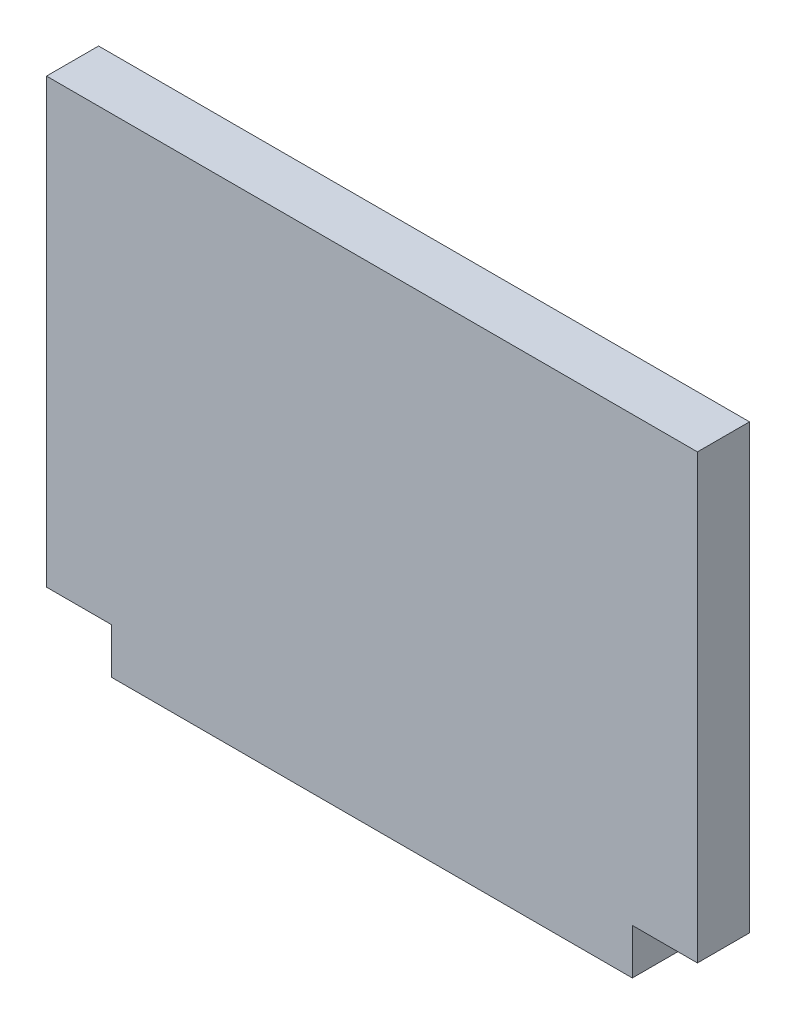
ISO-10303-21;
HEADER;
FILE_DESCRIPTION(('STEP AP214'),'2;1');
FILE_NAME('part.step','',(''),(''),'','','');
FILE_SCHEMA(('AUTOMOTIVE_DESIGN { 1 0 10303 214 1 1 1 1 }'));
ENDSEC;
DATA;
#1=APPLICATION_CONTEXT('core data for automotive mechanical design processes');
#2=APPLICATION_PROTOCOL_DEFINITION('international standard','automotive_design',2000,#1);
#3=PRODUCT_CONTEXT('',#1,'mechanical');
#4=PRODUCT('Part','Part','',(#3));
#5=PRODUCT_RELATED_PRODUCT_CATEGORY('part','',(#4));
#6=PRODUCT_DEFINITION_FORMATION('','',#4);
#7=PRODUCT_DEFINITION_CONTEXT('part definition',#1,'design');
#8=PRODUCT_DEFINITION('design','',#6,#7);
#9=PRODUCT_DEFINITION_SHAPE('','',#8);
#10=(LENGTH_UNIT() NAMED_UNIT(*) SI_UNIT(.MILLI.,.METRE.));
#11=(NAMED_UNIT(*) PLANE_ANGLE_UNIT() SI_UNIT($,.RADIAN.));
#12=(NAMED_UNIT(*) SI_UNIT($,.STERADIAN.) SOLID_ANGLE_UNIT());
#13=UNCERTAINTY_MEASURE_WITH_UNIT(LENGTH_MEASURE(1.E-05),#10,'distance_accuracy_value','');
#14=(GEOMETRIC_REPRESENTATION_CONTEXT(3) GLOBAL_UNCERTAINTY_ASSIGNED_CONTEXT((#13)) GLOBAL_UNIT_ASSIGNED_CONTEXT((#10,
#11,#12)) REPRESENTATION_CONTEXT('',''));
#15=CARTESIAN_POINT('',(0.,0.,0.));
#16=DIRECTION('',(0.,0.,1.));
#17=DIRECTION('',(1.,0.,0.));
#18=AXIS2_PLACEMENT_3D('',#15,#16,#17);
#19=CARTESIAN_POINT('',(-0.5,1.93602540378444,0.));
#20=DIRECTION('',(-1.,0.,0.));
#21=DIRECTION('',(0.,-1.,0.));
#22=AXIS2_PLACEMENT_3D('',#19,#20,#21);
#23=PLANE('',#22);
#24=DIRECTION('',(0.,-1.,0.));
#25=VECTOR('',#24,1.);
#26=CARTESIAN_POINT('',(-0.5,1.93602540378444,0.08));
#27=LINE('',#26,#25);
#28=CARTESIAN_POINT('',(-0.5,2.61602540378444,0.08));
#29=VERTEX_POINT('',#28);
#30=CARTESIAN_POINT('',(-0.5,1.93602540378444,0.08));
#31=VERTEX_POINT('',#30);
#32=EDGE_CURVE('E130',#29,#31,#27,.T.);
#33=ORIENTED_EDGE('',*,*,#32,.F.);
#34=DIRECTION('',(0.,0.,1.));
#35=VECTOR('',#34,1.);
#36=CARTESIAN_POINT('',(-0.5,2.61602540378444,0.));
#37=LINE('',#36,#35);
#38=CARTESIAN_POINT('',(-0.5,2.61602540378444,0.));
#39=VERTEX_POINT('',#38);
#40=EDGE_CURVE('E11',#39,#29,#37,.T.);
#41=ORIENTED_EDGE('',*,*,#40,.F.);
#42=DIRECTION('',(0.,-1.,0.));
#43=VECTOR('',#42,1.);
#44=CARTESIAN_POINT('',(-0.5,1.93602540378444,0.));
#45=LINE('',#44,#43);
#46=CARTESIAN_POINT('',(-0.5,1.93602540378444,0.));
#47=VERTEX_POINT('',#46);
#48=EDGE_CURVE('E150',#39,#47,#45,.T.);
#49=ORIENTED_EDGE('',*,*,#48,.T.);
#50=DIRECTION('',(0.,0.,1.));
#51=VECTOR('',#50,1.);
#52=CARTESIAN_POINT('',(-0.5,1.93602540378444,0.));
#53=LINE('',#52,#51);
#54=EDGE_CURVE('E36',#47,#31,#53,.T.);
#55=ORIENTED_EDGE('',*,*,#54,.T.);
#56=EDGE_LOOP('',(#33,#41,#49,#55));
#57=FACE_BOUND('',#56,.T.);
#58=ADVANCED_FACE('F33',(#57),#23,.T.);
#59=CARTESIAN_POINT('',(0.499999999999999,2.61602540378444,0.));
#60=DIRECTION('',(0.,1.,0.));
#61=DIRECTION('',(0.,0.,1.));
#62=AXIS2_PLACEMENT_3D('',#59,#60,#61);
#63=PLANE('',#62);
#64=DIRECTION('',(-1.,0.,0.));
#65=VECTOR('',#64,1.);
#66=CARTESIAN_POINT('',(0.499999999999999,2.61602540378444,0.08));
#67=LINE('',#66,#65);
#68=CARTESIAN_POINT('',(0.499999999999999,2.61602540378444,0.08));
#69=VERTEX_POINT('',#68);
#70=EDGE_CURVE('E148',#69,#29,#67,.T.);
#71=ORIENTED_EDGE('',*,*,#70,.F.);
#72=DIRECTION('',(0.,0.,1.));
#73=VECTOR('',#72,1.);
#74=CARTESIAN_POINT('',(0.499999999999999,2.61602540378444,0.));
#75=LINE('',#74,#73);
#76=CARTESIAN_POINT('',(0.499999999999999,2.61602540378444,0.));
#77=VERTEX_POINT('',#76);
#78=EDGE_CURVE('E42',#77,#69,#75,.T.);
#79=ORIENTED_EDGE('',*,*,#78,.F.);
#80=DIRECTION('',(-1.,0.,0.));
#81=VECTOR('',#80,1.);
#82=CARTESIAN_POINT('',(0.499999999999999,2.61602540378444,0.));
#83=LINE('',#82,#81);
#84=EDGE_CURVE('E120',#77,#39,#83,.T.);
#85=ORIENTED_EDGE('',*,*,#84,.T.);
#86=ORIENTED_EDGE('',*,*,#40,.T.);
#87=EDGE_LOOP('',(#71,#79,#85,#86));
#88=FACE_BOUND('',#87,.T.);
#89=ADVANCED_FACE('F162',(#88),#63,.T.);
#90=CARTESIAN_POINT('',(0.499999999999999,1.93602540378444,0.));
#91=DIRECTION('',(1.,0.,0.));
#92=DIRECTION('',(0.,1.,0.));
#93=AXIS2_PLACEMENT_3D('',#90,#91,#92);
#94=PLANE('',#93);
#95=DIRECTION('',(0.,1.,0.));
#96=VECTOR('',#95,1.);
#97=CARTESIAN_POINT('',(0.499999999999999,1.93602540378444,0.08));
#98=LINE('',#97,#96);
#99=CARTESIAN_POINT('',(0.499999999999999,1.93602540378444,0.08));
#100=VERTEX_POINT('',#99);
#101=EDGE_CURVE('E107',#100,#69,#98,.T.);
#102=ORIENTED_EDGE('',*,*,#101,.F.);
#103=DIRECTION('',(0.,0.,1.));
#104=VECTOR('',#103,1.);
#105=CARTESIAN_POINT('',(0.499999999999999,1.93602540378444,0.));
#106=LINE('',#105,#104);
#107=CARTESIAN_POINT('',(0.499999999999999,1.93602540378444,0.));
#108=VERTEX_POINT('',#107);
#109=EDGE_CURVE('E102',#108,#100,#106,.T.);
#110=ORIENTED_EDGE('',*,*,#109,.F.);
#111=DIRECTION('',(0.,1.,0.));
#112=VECTOR('',#111,1.);
#113=CARTESIAN_POINT('',(0.499999999999999,1.93602540378444,0.));
#114=LINE('',#113,#112);
#115=EDGE_CURVE('E105',#108,#77,#114,.T.);
#116=ORIENTED_EDGE('',*,*,#115,.T.);
#117=ORIENTED_EDGE('',*,*,#78,.T.);
#118=EDGE_LOOP('',(#102,#110,#116,#117));
#119=FACE_BOUND('',#118,.T.);
#120=ADVANCED_FACE('F104',(#119),#94,.T.);
#121=CARTESIAN_POINT('',(0.499999999999999,1.93602540378444,0.));
#122=DIRECTION('',(0.,-1.,0.));
#123=DIRECTION('',(0.,0.,-1.));
#124=AXIS2_PLACEMENT_3D('',#121,#122,#123);
#125=PLANE('',#124);
#126=DIRECTION('',(1.,0.,0.));
#127=VECTOR('',#126,1.);
#128=CARTESIAN_POINT('',(0.499999999999999,1.93602540378444,0.08));
#129=LINE('',#128,#127);
#130=CARTESIAN_POINT('',(0.399999999999999,1.93602540378444,0.08));
#131=VERTEX_POINT('',#130);
#132=EDGE_CURVE('E145',#131,#100,#129,.T.);
#133=ORIENTED_EDGE('',*,*,#132,.F.);
#134=DIRECTION('',(0.,0.,1.));
#135=VECTOR('',#134,1.);
#136=CARTESIAN_POINT('',(0.399999999999999,1.93602540378444,0.));
#137=LINE('',#136,#135);
#138=CARTESIAN_POINT('',(0.399999999999999,1.93602540378444,0.));
#139=VERTEX_POINT('',#138);
#140=EDGE_CURVE('E112',#139,#131,#137,.T.);
#141=ORIENTED_EDGE('',*,*,#140,.F.);
#142=DIRECTION('',(1.,0.,0.));
#143=VECTOR('',#142,1.);
#144=CARTESIAN_POINT('',(0.499999999999999,1.93602540378444,0.));
#145=LINE('',#144,#143);
#146=EDGE_CURVE('E118',#139,#108,#145,.T.);
#147=ORIENTED_EDGE('',*,*,#146,.T.);
#148=ORIENTED_EDGE('',*,*,#109,.T.);
#149=EDGE_LOOP('',(#133,#141,#147,#148));
#150=FACE_BOUND('',#149,.T.);
#151=ADVANCED_FACE('F122',(#150),#125,.T.);
#152=CARTESIAN_POINT('',(0.399999999999999,1.93602540378444,0.));
#153=DIRECTION('',(1.,0.,0.));
#154=DIRECTION('',(0.,1.,0.));
#155=AXIS2_PLACEMENT_3D('',#152,#153,#154);
#156=PLANE('',#155);
#157=DIRECTION('',(0.,1.,0.));
#158=VECTOR('',#157,1.);
#159=CARTESIAN_POINT('',(0.399999999999999,1.93602540378444,0.08));
#160=LINE('',#159,#158);
#161=CARTESIAN_POINT('',(0.4,1.86602540378444,0.08));
#162=VERTEX_POINT('',#161);
#163=EDGE_CURVE('E142',#162,#131,#160,.T.);
#164=ORIENTED_EDGE('',*,*,#163,.F.);
#165=DIRECTION('',(0.,0.,1.));
#166=VECTOR('',#165,1.);
#167=CARTESIAN_POINT('',(0.4,1.86602540378444,0.));
#168=LINE('',#167,#166);
#169=CARTESIAN_POINT('',(0.4,1.86602540378444,0.));
#170=VERTEX_POINT('',#169);
#171=EDGE_CURVE('E154',#170,#162,#168,.T.);
#172=ORIENTED_EDGE('',*,*,#171,.F.);
#173=DIRECTION('',(0.,1.,0.));
#174=VECTOR('',#173,1.);
#175=CARTESIAN_POINT('',(0.399999999999999,1.93602540378444,0.));
#176=LINE('',#175,#174);
#177=EDGE_CURVE('E123',#170,#139,#176,.T.);
#178=ORIENTED_EDGE('',*,*,#177,.T.);
#179=ORIENTED_EDGE('',*,*,#140,.T.);
#180=EDGE_LOOP('',(#164,#172,#178,#179));
#181=FACE_BOUND('',#180,.T.);
#182=ADVANCED_FACE('F175',(#181),#156,.T.);
#183=CARTESIAN_POINT('',(0.4,1.86602540378444,0.));
#184=DIRECTION('',(0.,-1.,0.));
#185=DIRECTION('',(1.,0.,0.));
#186=AXIS2_PLACEMENT_3D('',#183,#184,#185);
#187=PLANE('',#186);
#188=DIRECTION('',(1.,0.,0.));
#189=VECTOR('',#188,1.);
#190=CARTESIAN_POINT('',(0.4,1.86602540378444,0.08));
#191=LINE('',#190,#189);
#192=CARTESIAN_POINT('',(-0.4,1.86602540378444,0.08));
#193=VERTEX_POINT('',#192);
#194=EDGE_CURVE('E139',#193,#162,#191,.T.);
#195=ORIENTED_EDGE('',*,*,#194,.F.);
#196=DIRECTION('',(0.,0.,1.));
#197=VECTOR('',#196,1.);
#198=CARTESIAN_POINT('',(-0.4,1.86602540378444,0.));
#199=LINE('',#198,#197);
#200=CARTESIAN_POINT('',(-0.4,1.86602540378444,0.));
#201=VERTEX_POINT('',#200);
#202=EDGE_CURVE('E156',#201,#193,#199,.T.);
#203=ORIENTED_EDGE('',*,*,#202,.F.);
#204=DIRECTION('',(1.,0.,0.));
#205=VECTOR('',#204,1.);
#206=CARTESIAN_POINT('',(0.4,1.86602540378444,0.));
#207=LINE('',#206,#205);
#208=EDGE_CURVE('E125',#201,#170,#207,.T.);
#209=ORIENTED_EDGE('',*,*,#208,.T.);
#210=ORIENTED_EDGE('',*,*,#171,.T.);
#211=EDGE_LOOP('',(#195,#203,#209,#210));
#212=FACE_BOUND('',#211,.T.);
#213=ADVANCED_FACE('F178',(#212),#187,.T.);
#214=CARTESIAN_POINT('',(-0.4,1.93602540378444,0.));
#215=DIRECTION('',(-1.,0.,0.));
#216=DIRECTION('',(0.,-1.,0.));
#217=AXIS2_PLACEMENT_3D('',#214,#215,#216);
#218=PLANE('',#217);
#219=DIRECTION('',(0.,-1.,0.));
#220=VECTOR('',#219,1.);
#221=CARTESIAN_POINT('',(-0.4,1.93602540378444,0.08));
#222=LINE('',#221,#220);
#223=CARTESIAN_POINT('',(-0.4,1.93602540378444,0.08));
#224=VERTEX_POINT('',#223);
#225=EDGE_CURVE('E136',#224,#193,#222,.T.);
#226=ORIENTED_EDGE('',*,*,#225,.F.);
#227=DIRECTION('',(0.,0.,1.));
#228=VECTOR('',#227,1.);
#229=CARTESIAN_POINT('',(-0.4,1.93602540378444,0.));
#230=LINE('',#229,#228);
#231=CARTESIAN_POINT('',(-0.4,1.93602540378444,0.));
#232=VERTEX_POINT('',#231);
#233=EDGE_CURVE('E157',#232,#224,#230,.T.);
#234=ORIENTED_EDGE('',*,*,#233,.F.);
#235=DIRECTION('',(0.,-1.,0.));
#236=VECTOR('',#235,1.);
#237=CARTESIAN_POINT('',(-0.4,1.93602540378444,0.));
#238=LINE('',#237,#236);
#239=EDGE_CURVE('E259',#232,#201,#238,.T.);
#240=ORIENTED_EDGE('',*,*,#239,.T.);
#241=ORIENTED_EDGE('',*,*,#202,.T.);
#242=EDGE_LOOP('',(#226,#234,#240,#241));
#243=FACE_BOUND('',#242,.T.);
#244=ADVANCED_FACE('F182',(#243),#218,.T.);
#245=CARTESIAN_POINT('',(-0.5,1.93602540378444,0.));
#246=DIRECTION('',(0.,-1.,0.));
#247=DIRECTION('',(1.,0.,0.));
#248=AXIS2_PLACEMENT_3D('',#245,#246,#247);
#249=PLANE('',#248);
#250=DIRECTION('',(1.,0.,0.));
#251=VECTOR('',#250,1.);
#252=CARTESIAN_POINT('',(-0.5,1.93602540378444,0.08));
#253=LINE('',#252,#251);
#254=EDGE_CURVE('E133',#31,#224,#253,.T.);
#255=ORIENTED_EDGE('',*,*,#254,.F.);
#256=ORIENTED_EDGE('',*,*,#54,.F.);
#257=DIRECTION('',(1.,0.,0.));
#258=VECTOR('',#257,1.);
#259=CARTESIAN_POINT('',(-0.5,1.93602540378444,0.));
#260=LINE('',#259,#258);
#261=EDGE_CURVE('E260',#47,#232,#260,.T.);
#262=ORIENTED_EDGE('',*,*,#261,.T.);
#263=ORIENTED_EDGE('',*,*,#233,.T.);
#264=EDGE_LOOP('',(#255,#256,#262,#263));
#265=FACE_BOUND('',#264,.T.);
#266=ADVANCED_FACE('F159',(#265),#249,.T.);
#267=CARTESIAN_POINT('',(0.,0.,0.));
#268=DIRECTION('',(0.,0.,1.));
#269=DIRECTION('',(1.,0.,0.));
#270=AXIS2_PLACEMENT_3D('',#267,#268,#269);
#271=PLANE('',#270);
#272=ORIENTED_EDGE('',*,*,#48,.F.);
#273=ORIENTED_EDGE('',*,*,#84,.F.);
#274=ORIENTED_EDGE('',*,*,#115,.F.);
#275=ORIENTED_EDGE('',*,*,#146,.F.);
#276=ORIENTED_EDGE('',*,*,#177,.F.);
#277=ORIENTED_EDGE('',*,*,#208,.F.);
#278=ORIENTED_EDGE('',*,*,#239,.F.);
#279=ORIENTED_EDGE('',*,*,#261,.F.);
#280=EDGE_LOOP('',(#272,#273,#274,#275,#276,#277,#278,#279));
#281=FACE_BOUND('',#280,.T.);
#282=ADVANCED_FACE('F116',(#281),#271,.F.);
#283=CARTESIAN_POINT('',(0.,0.,0.08));
#284=DIRECTION('',(0.,0.,1.));
#285=DIRECTION('',(1.,0.,0.));
#286=AXIS2_PLACEMENT_3D('',#283,#284,#285);
#287=PLANE('',#286);
#288=ORIENTED_EDGE('',*,*,#32,.T.);
#289=ORIENTED_EDGE('',*,*,#254,.T.);
#290=ORIENTED_EDGE('',*,*,#225,.T.);
#291=ORIENTED_EDGE('',*,*,#194,.T.);
#292=ORIENTED_EDGE('',*,*,#163,.T.);
#293=ORIENTED_EDGE('',*,*,#132,.T.);
#294=ORIENTED_EDGE('',*,*,#101,.T.);
#295=ORIENTED_EDGE('',*,*,#70,.T.);
#296=EDGE_LOOP('',(#288,#289,#290,#291,#292,#293,#294,#295));
#297=FACE_BOUND('',#296,.T.);
#298=ADVANCED_FACE('F161',(#297),#287,.T.);
#299=CLOSED_SHELL('',(#58,#89,#120,#151,#182,#213,#244,#266,#282,#298));
#300=MANIFOLD_SOLID_BREP('B2',#299);
#301=ADVANCED_BREP_SHAPE_REPRESENTATION('',(#18,#300),#14);
#302=SHAPE_DEFINITION_REPRESENTATION(#9,#301);
ENDSEC;
END-ISO-10303-21;
